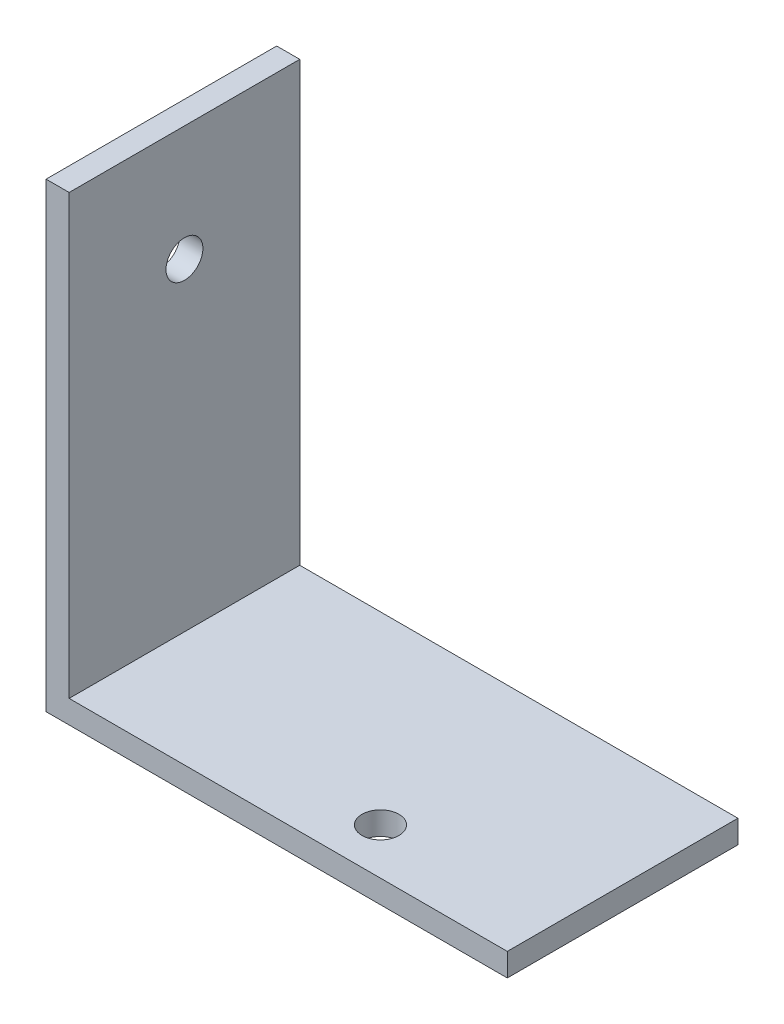
ISO-10303-21;
HEADER;
FILE_DESCRIPTION(('STEP AP214'),'2;1');
FILE_NAME('part.step','',(''),(''),'','','');
FILE_SCHEMA(('AUTOMOTIVE_DESIGN { 1 0 10303 214 1 1 1 1 }'));
ENDSEC;
DATA;
#1=APPLICATION_CONTEXT('core data for automotive mechanical design processes');
#2=APPLICATION_PROTOCOL_DEFINITION('international standard','automotive_design',2000,#1);
#3=PRODUCT_CONTEXT('',#1,'mechanical');
#4=PRODUCT('Part','Part','',(#3));
#5=PRODUCT_RELATED_PRODUCT_CATEGORY('part','',(#4));
#6=PRODUCT_DEFINITION_FORMATION('','',#4);
#7=PRODUCT_DEFINITION_CONTEXT('part definition',#1,'design');
#8=PRODUCT_DEFINITION('design','',#6,#7);
#9=PRODUCT_DEFINITION_SHAPE('','',#8);
#10=(LENGTH_UNIT() NAMED_UNIT(*) SI_UNIT(.MILLI.,.METRE.));
#11=(NAMED_UNIT(*) PLANE_ANGLE_UNIT() SI_UNIT($,.RADIAN.));
#12=(NAMED_UNIT(*) SI_UNIT($,.STERADIAN.) SOLID_ANGLE_UNIT());
#13=UNCERTAINTY_MEASURE_WITH_UNIT(LENGTH_MEASURE(1.E-05),#10,'distance_accuracy_value','');
#14=(GEOMETRIC_REPRESENTATION_CONTEXT(3) GLOBAL_UNCERTAINTY_ASSIGNED_CONTEXT((#13)) GLOBAL_UNIT_ASSIGNED_CONTEXT((#10,
#11,#12)) REPRESENTATION_CONTEXT('',''));
#15=CARTESIAN_POINT('',(0.,0.,0.));
#16=DIRECTION('',(0.,0.,1.));
#17=DIRECTION('',(1.,0.,0.));
#18=AXIS2_PLACEMENT_3D('',#15,#16,#17);
#19=CARTESIAN_POINT('',(0.,40.,20.));
#20=DIRECTION('',(1.,0.,0.));
#21=DIRECTION('',(0.,1.,0.));
#22=AXIS2_PLACEMENT_3D('',#19,#20,#21);
#23=PLANE('',#22);
#24=CARTESIAN_POINT('',(0.,30.,10.));
#25=DIRECTION('',(-1.,0.,0.));
#26=DIRECTION('',(0.,-1.,0.));
#27=AXIS2_PLACEMENT_3D('',#24,#25,#26);
#28=CIRCLE('',#27,1.6);
#29=CARTESIAN_POINT('',(0.,28.4,10.));
#30=VERTEX_POINT('',#29);
#31=EDGE_CURVE('E140',#30,#30,#28,.T.);
#32=ORIENTED_EDGE('',*,*,#31,.F.);
#33=EDGE_LOOP('',(#32));
#34=FACE_BOUND('',#33,.T.);
#35=DIRECTION('',(0.,-1.,0.));
#36=VECTOR('',#35,1.);
#37=CARTESIAN_POINT('',(0.,40.,0.));
#38=LINE('',#37,#36);
#39=CARTESIAN_POINT('',(0.,40.,0.));
#40=VERTEX_POINT('',#39);
#41=CARTESIAN_POINT('',(0.,0.,0.));
#42=VERTEX_POINT('',#41);
#43=EDGE_CURVE('E123',#40,#42,#38,.T.);
#44=ORIENTED_EDGE('',*,*,#43,.T.);
#45=DIRECTION('',(0.,0.,-1.));
#46=VECTOR('',#45,1.);
#47=CARTESIAN_POINT('',(0.,0.,20.));
#48=LINE('',#47,#46);
#49=CARTESIAN_POINT('',(0.,0.,20.));
#50=VERTEX_POINT('',#49);
#51=EDGE_CURVE('E11',#50,#42,#48,.T.);
#52=ORIENTED_EDGE('',*,*,#51,.F.);
#53=DIRECTION('',(0.,-1.,0.));
#54=VECTOR('',#53,1.);
#55=CARTESIAN_POINT('',(0.,40.,20.));
#56=LINE('',#55,#54);
#57=CARTESIAN_POINT('',(0.,40.,20.));
#58=VERTEX_POINT('',#57);
#59=EDGE_CURVE('E134',#58,#50,#56,.T.);
#60=ORIENTED_EDGE('',*,*,#59,.F.);
#61=DIRECTION('',(0.,0.,-1.));
#62=VECTOR('',#61,1.);
#63=CARTESIAN_POINT('',(0.,40.,20.));
#64=LINE('',#63,#62);
#65=EDGE_CURVE('E119',#58,#40,#64,.T.);
#66=ORIENTED_EDGE('',*,*,#65,.T.);
#67=EDGE_LOOP('',(#44,#52,#60,#66));
#68=FACE_BOUND('',#67,.T.);
#69=ADVANCED_FACE('F37',(#34,#68),#23,.F.);
#70=CARTESIAN_POINT('',(0.,0.,20.));
#71=DIRECTION('',(0.,1.,0.));
#72=DIRECTION('',(0.,0.,1.));
#73=AXIS2_PLACEMENT_3D('',#70,#71,#72);
#74=PLANE('',#73);
#75=CARTESIAN_POINT('',(25.,0.,16.));
#76=DIRECTION('',(0.,-1.,0.));
#77=DIRECTION('',(0.,0.,-1.));
#78=AXIS2_PLACEMENT_3D('',#75,#76,#77);
#79=CIRCLE('',#78,1.6);
#80=CARTESIAN_POINT('',(25.,0.,14.4));
#81=VERTEX_POINT('',#80);
#82=EDGE_CURVE('E148',#81,#81,#79,.T.);
#83=ORIENTED_EDGE('',*,*,#82,.F.);
#84=EDGE_LOOP('',(#83));
#85=FACE_BOUND('',#84,.T.);
#86=DIRECTION('',(1.,0.,0.));
#87=VECTOR('',#86,1.);
#88=CARTESIAN_POINT('',(0.,0.,0.));
#89=LINE('',#88,#87);
#90=CARTESIAN_POINT('',(40.,0.,0.));
#91=VERTEX_POINT('',#90);
#92=EDGE_CURVE('E126',#42,#91,#89,.T.);
#93=ORIENTED_EDGE('',*,*,#92,.T.);
#94=DIRECTION('',(0.,0.,-1.));
#95=VECTOR('',#94,1.);
#96=CARTESIAN_POINT('',(40.,0.,20.));
#97=LINE('',#96,#95);
#98=CARTESIAN_POINT('',(40.,0.,20.));
#99=VERTEX_POINT('',#98);
#100=EDGE_CURVE('E46',#99,#91,#97,.T.);
#101=ORIENTED_EDGE('',*,*,#100,.F.);
#102=DIRECTION('',(1.,0.,0.));
#103=VECTOR('',#102,1.);
#104=CARTESIAN_POINT('',(0.,0.,20.));
#105=LINE('',#104,#103);
#106=EDGE_CURVE('E92',#50,#99,#105,.T.);
#107=ORIENTED_EDGE('',*,*,#106,.F.);
#108=ORIENTED_EDGE('',*,*,#51,.T.);
#109=EDGE_LOOP('',(#93,#101,#107,#108));
#110=FACE_BOUND('',#109,.T.);
#111=ADVANCED_FACE('F154',(#85,#110),#74,.F.);
#112=CARTESIAN_POINT('',(40.,0.,20.));
#113=DIRECTION('',(-1.,0.,0.));
#114=DIRECTION('',(0.,0.,1.));
#115=AXIS2_PLACEMENT_3D('',#112,#113,#114);
#116=PLANE('',#115);
#117=DIRECTION('',(0.,1.,0.));
#118=VECTOR('',#117,1.);
#119=CARTESIAN_POINT('',(40.,0.,0.));
#120=LINE('',#119,#118);
#121=CARTESIAN_POINT('',(40.,2.,0.));
#122=VERTEX_POINT('',#121);
#123=EDGE_CURVE('E129',#91,#122,#120,.T.);
#124=ORIENTED_EDGE('',*,*,#123,.T.);
#125=DIRECTION('',(0.,0.,-1.));
#126=VECTOR('',#125,1.);
#127=CARTESIAN_POINT('',(40.,2.,20.));
#128=LINE('',#127,#126);
#129=CARTESIAN_POINT('',(40.,2.,20.));
#130=VERTEX_POINT('',#129);
#131=EDGE_CURVE('E114',#130,#122,#128,.T.);
#132=ORIENTED_EDGE('',*,*,#131,.F.);
#133=DIRECTION('',(0.,1.,0.));
#134=VECTOR('',#133,1.);
#135=CARTESIAN_POINT('',(40.,0.,20.));
#136=LINE('',#135,#134);
#137=EDGE_CURVE('E105',#99,#130,#136,.T.);
#138=ORIENTED_EDGE('',*,*,#137,.F.);
#139=ORIENTED_EDGE('',*,*,#100,.T.);
#140=EDGE_LOOP('',(#124,#132,#138,#139));
#141=FACE_BOUND('',#140,.T.);
#142=ADVANCED_FACE('F157',(#141),#116,.F.);
#143=CARTESIAN_POINT('',(40.,2.,20.));
#144=DIRECTION('',(0.,-1.,0.));
#145=DIRECTION('',(1.,0.,0.));
#146=AXIS2_PLACEMENT_3D('',#143,#144,#145);
#147=PLANE('',#146);
#148=CARTESIAN_POINT('',(25.,2.,16.));
#149=DIRECTION('',(0.,-1.,0.));
#150=DIRECTION('',(1.,0.,0.));
#151=AXIS2_PLACEMENT_3D('',#148,#149,#150);
#152=CIRCLE('',#151,1.6);
#153=CARTESIAN_POINT('',(26.6,2.,16.));
#154=VERTEX_POINT('',#153);
#155=EDGE_CURVE('E40',#154,#154,#152,.T.);
#156=ORIENTED_EDGE('',*,*,#155,.T.);
#157=EDGE_LOOP('',(#156));
#158=FACE_BOUND('',#157,.T.);
#159=DIRECTION('',(-1.,0.,0.));
#160=VECTOR('',#159,1.);
#161=CARTESIAN_POINT('',(40.,2.,0.));
#162=LINE('',#161,#160);
#163=CARTESIAN_POINT('',(2.,2.,0.));
#164=VERTEX_POINT('',#163);
#165=EDGE_CURVE('E113',#122,#164,#162,.T.);
#166=ORIENTED_EDGE('',*,*,#165,.T.);
#167=DIRECTION('',(0.,0.,-1.));
#168=VECTOR('',#167,1.);
#169=CARTESIAN_POINT('',(2.,2.,20.));
#170=LINE('',#169,#168);
#171=CARTESIAN_POINT('',(2.,2.,20.));
#172=VERTEX_POINT('',#171);
#173=EDGE_CURVE('E110',#172,#164,#170,.T.);
#174=ORIENTED_EDGE('',*,*,#173,.F.);
#175=DIRECTION('',(-1.,0.,0.));
#176=VECTOR('',#175,1.);
#177=CARTESIAN_POINT('',(40.,2.,20.));
#178=LINE('',#177,#176);
#179=EDGE_CURVE('E99',#130,#172,#178,.T.);
#180=ORIENTED_EDGE('',*,*,#179,.F.);
#181=ORIENTED_EDGE('',*,*,#131,.T.);
#182=EDGE_LOOP('',(#166,#174,#180,#181));
#183=FACE_BOUND('',#182,.T.);
#184=ADVANCED_FACE('F111',(#158,#183),#147,.F.);
#185=CARTESIAN_POINT('',(2.,2.,20.));
#186=DIRECTION('',(-1.,0.,0.));
#187=DIRECTION('',(0.,-1.,0.));
#188=AXIS2_PLACEMENT_3D('',#185,#186,#187);
#189=PLANE('',#188);
#190=CARTESIAN_POINT('',(2.,30.,10.));
#191=DIRECTION('',(-1.,0.,0.));
#192=DIRECTION('',(0.,-1.,0.));
#193=AXIS2_PLACEMENT_3D('',#190,#191,#192);
#194=CIRCLE('',#193,1.6);
#195=CARTESIAN_POINT('',(2.,28.4,10.));
#196=VERTEX_POINT('',#195);
#197=EDGE_CURVE('E127',#196,#196,#194,.T.);
#198=ORIENTED_EDGE('',*,*,#197,.T.);
#199=EDGE_LOOP('',(#198));
#200=FACE_BOUND('',#199,.T.);
#201=DIRECTION('',(0.,1.,0.));
#202=VECTOR('',#201,1.);
#203=CARTESIAN_POINT('',(2.,2.,0.));
#204=LINE('',#203,#202);
#205=CARTESIAN_POINT('',(2.,40.,0.));
#206=VERTEX_POINT('',#205);
#207=EDGE_CURVE('E78',#164,#206,#204,.T.);
#208=ORIENTED_EDGE('',*,*,#207,.T.);
#209=DIRECTION('',(0.,0.,-1.));
#210=VECTOR('',#209,1.);
#211=CARTESIAN_POINT('',(2.,40.,20.));
#212=LINE('',#211,#210);
#213=CARTESIAN_POINT('',(2.,40.,20.));
#214=VERTEX_POINT('',#213);
#215=EDGE_CURVE('E115',#214,#206,#212,.T.);
#216=ORIENTED_EDGE('',*,*,#215,.F.);
#217=DIRECTION('',(0.,1.,0.));
#218=VECTOR('',#217,1.);
#219=CARTESIAN_POINT('',(2.,2.,20.));
#220=LINE('',#219,#218);
#221=EDGE_CURVE('E103',#172,#214,#220,.T.);
#222=ORIENTED_EDGE('',*,*,#221,.F.);
#223=ORIENTED_EDGE('',*,*,#173,.T.);
#224=EDGE_LOOP('',(#208,#216,#222,#223));
#225=FACE_BOUND('',#224,.T.);
#226=ADVANCED_FACE('F117',(#200,#225),#189,.F.);
#227=CARTESIAN_POINT('',(2.,40.,20.));
#228=DIRECTION('',(0.,-1.,0.));
#229=DIRECTION('',(0.,0.,-1.));
#230=AXIS2_PLACEMENT_3D('',#227,#228,#229);
#231=PLANE('',#230);
#232=DIRECTION('',(-1.,0.,0.));
#233=VECTOR('',#232,1.);
#234=CARTESIAN_POINT('',(2.,40.,0.));
#235=LINE('',#234,#233);
#236=EDGE_CURVE('E84',#206,#40,#235,.T.);
#237=ORIENTED_EDGE('',*,*,#236,.T.);
#238=ORIENTED_EDGE('',*,*,#65,.F.);
#239=DIRECTION('',(-1.,0.,0.));
#240=VECTOR('',#239,1.);
#241=CARTESIAN_POINT('',(2.,40.,20.));
#242=LINE('',#241,#240);
#243=EDGE_CURVE('E55',#214,#58,#242,.T.);
#244=ORIENTED_EDGE('',*,*,#243,.F.);
#245=ORIENTED_EDGE('',*,*,#215,.T.);
#246=EDGE_LOOP('',(#237,#238,#244,#245));
#247=FACE_BOUND('',#246,.T.);
#248=ADVANCED_FACE('F162',(#247),#231,.F.);
#249=CARTESIAN_POINT('',(0.,0.,20.));
#250=DIRECTION('',(0.,0.,1.));
#251=DIRECTION('',(1.,0.,0.));
#252=AXIS2_PLACEMENT_3D('',#249,#250,#251);
#253=PLANE('',#252);
#254=ORIENTED_EDGE('',*,*,#59,.T.);
#255=ORIENTED_EDGE('',*,*,#106,.T.);
#256=ORIENTED_EDGE('',*,*,#137,.T.);
#257=ORIENTED_EDGE('',*,*,#179,.T.);
#258=ORIENTED_EDGE('',*,*,#221,.T.);
#259=ORIENTED_EDGE('',*,*,#243,.T.);
#260=EDGE_LOOP('',(#254,#255,#256,#257,#258,#259));
#261=FACE_BOUND('',#260,.T.);
#262=ADVANCED_FACE('F101',(#261),#253,.T.);
#263=CARTESIAN_POINT('',(0.,0.,0.));
#264=DIRECTION('',(0.,0.,1.));
#265=DIRECTION('',(1.,0.,0.));
#266=AXIS2_PLACEMENT_3D('',#263,#264,#265);
#267=PLANE('',#266);
#268=ORIENTED_EDGE('',*,*,#43,.F.);
#269=ORIENTED_EDGE('',*,*,#236,.F.);
#270=ORIENTED_EDGE('',*,*,#207,.F.);
#271=ORIENTED_EDGE('',*,*,#165,.F.);
#272=ORIENTED_EDGE('',*,*,#123,.F.);
#273=ORIENTED_EDGE('',*,*,#92,.F.);
#274=EDGE_LOOP('',(#268,#269,#270,#271,#272,#273));
#275=FACE_BOUND('',#274,.T.);
#276=ADVANCED_FACE('F160',(#275),#267,.F.);
#277=CARTESIAN_POINT('',(40.,30.,10.));
#278=DIRECTION('',(-1.,0.,0.));
#279=DIRECTION('',(0.,-1.,0.));
#280=AXIS2_PLACEMENT_3D('',#277,#278,#279);
#281=CYLINDRICAL_SURFACE('',#280,1.6);
#282=ORIENTED_EDGE('',*,*,#31,.T.);
#283=EDGE_LOOP('',(#282));
#284=FACE_BOUND('',#283,.T.);
#285=ORIENTED_EDGE('',*,*,#197,.F.);
#286=EDGE_LOOP('',(#285));
#287=FACE_BOUND('',#286,.T.);
#288=ADVANCED_FACE('F192',(#284,#287),#281,.F.);
#289=CARTESIAN_POINT('',(25.,40.,16.));
#290=DIRECTION('',(0.,-1.,0.));
#291=DIRECTION('',(0.,0.,-1.));
#292=AXIS2_PLACEMENT_3D('',#289,#290,#291);
#293=CYLINDRICAL_SURFACE('',#292,1.6);
#294=ORIENTED_EDGE('',*,*,#82,.T.);
#295=EDGE_LOOP('',(#294));
#296=FACE_BOUND('',#295,.T.);
#297=ORIENTED_EDGE('',*,*,#155,.F.);
#298=EDGE_LOOP('',(#297));
#299=FACE_BOUND('',#298,.T.);
#300=ADVANCED_FACE('F190',(#296,#299),#293,.F.);
#301=CLOSED_SHELL('',(#69,#111,#142,#184,#226,#248,#262,#276,#288,#300));
#302=MANIFOLD_SOLID_BREP('B2',#301);
#303=ADVANCED_BREP_SHAPE_REPRESENTATION('',(#18,#302),#14);
#304=SHAPE_DEFINITION_REPRESENTATION(#9,#303);
ENDSEC;
END-ISO-10303-21;
